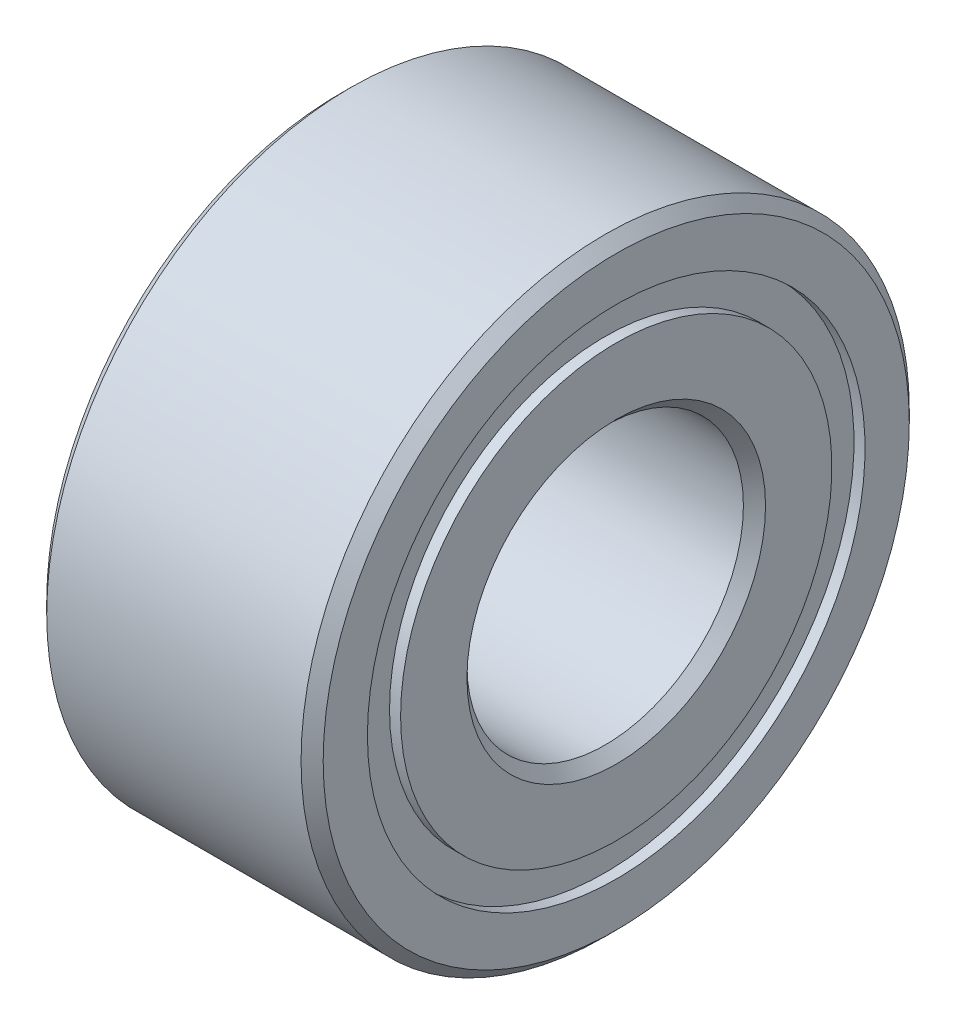
ISO-10303-21;
HEADER;
FILE_DESCRIPTION(('STEP AP214'),'2;1');
FILE_NAME('part.step','',(''),(''),'','','');
FILE_SCHEMA(('AUTOMOTIVE_DESIGN { 1 0 10303 214 1 1 1 1 }'));
ENDSEC;
DATA;
#1=APPLICATION_CONTEXT('core data for automotive mechanical design processes');
#2=APPLICATION_PROTOCOL_DEFINITION('international standard','automotive_design',2000,#1);
#3=PRODUCT_CONTEXT('',#1,'mechanical');
#4=PRODUCT('Part','Part','',(#3));
#5=PRODUCT_RELATED_PRODUCT_CATEGORY('part','',(#4));
#6=PRODUCT_DEFINITION_FORMATION('','',#4);
#7=PRODUCT_DEFINITION_CONTEXT('part definition',#1,'design');
#8=PRODUCT_DEFINITION('design','',#6,#7);
#9=PRODUCT_DEFINITION_SHAPE('','',#8);
#10=(LENGTH_UNIT() NAMED_UNIT(*) SI_UNIT(.MILLI.,.METRE.));
#11=(NAMED_UNIT(*) PLANE_ANGLE_UNIT() SI_UNIT($,.RADIAN.));
#12=(NAMED_UNIT(*) SI_UNIT($,.STERADIAN.) SOLID_ANGLE_UNIT());
#13=UNCERTAINTY_MEASURE_WITH_UNIT(LENGTH_MEASURE(1.E-05),#10,'distance_accuracy_value','');
#14=(GEOMETRIC_REPRESENTATION_CONTEXT(3) GLOBAL_UNCERTAINTY_ASSIGNED_CONTEXT((#13)) GLOBAL_UNIT_ASSIGNED_CONTEXT((#10,
#11,#12)) REPRESENTATION_CONTEXT('',''));
#15=CARTESIAN_POINT('',(0.,0.,0.));
#16=DIRECTION('',(0.,0.,1.));
#17=DIRECTION('',(1.,0.,0.));
#18=AXIS2_PLACEMENT_3D('',#15,#16,#17);
#19=CARTESIAN_POINT('',(-2.5,3.9,0.));
#20=DIRECTION('',(1.,0.,0.));
#21=DIRECTION('',(0.,0.,-1.));
#22=AXIS2_PLACEMENT_3D('',#19,#20,#21);
#23=PLANE('',#22);
#24=CARTESIAN_POINT('',(-2.5,0.,0.));
#25=DIRECTION('',(1.,0.,0.));
#26=DIRECTION('',(0.,0.,-1.));
#27=AXIS2_PLACEMENT_3D('',#24,#25,#26);
#28=CIRCLE('',#27,2.7);
#29=CARTESIAN_POINT('',(-2.5,0.,-2.7));
#30=VERTEX_POINT('',#29);
#31=EDGE_CURVE('E42',#30,#30,#28,.T.);
#32=ORIENTED_EDGE('',*,*,#31,.T.);
#33=EDGE_LOOP('',(#32));
#34=FACE_BOUND('',#33,.T.);
#35=CARTESIAN_POINT('',(-2.5,0.,0.));
#36=DIRECTION('',(-1.,0.,0.));
#37=DIRECTION('',(0.,0.,1.));
#38=AXIS2_PLACEMENT_3D('',#35,#36,#37);
#39=CIRCLE('',#38,3.9);
#40=CARTESIAN_POINT('',(-2.5,0.,3.9));
#41=VERTEX_POINT('',#40);
#42=EDGE_CURVE('E67',#41,#41,#39,.T.);
#43=ORIENTED_EDGE('',*,*,#42,.T.);
#44=EDGE_LOOP('',(#43));
#45=FACE_BOUND('',#44,.T.);
#46=ADVANCED_FACE('F34',(#34,#45),#23,.F.);
#47=CARTESIAN_POINT('',(-9.57865229498036,0.,0.));
#48=DIRECTION('',(-1.,0.,0.));
#49=DIRECTION('',(0.,0.,1.));
#50=AXIS2_PLACEMENT_3D('',#47,#48,#49);
#51=CYLINDRICAL_SURFACE('',#50,3.9);
#52=ORIENTED_EDGE('',*,*,#42,.F.);
#53=EDGE_LOOP('',(#52));
#54=FACE_BOUND('',#53,.T.);
#55=CARTESIAN_POINT('',(-2.3,0.,0.));
#56=DIRECTION('',(-1.,0.,0.));
#57=DIRECTION('',(0.,0.,1.));
#58=AXIS2_PLACEMENT_3D('',#55,#56,#57);
#59=CIRCLE('',#58,3.9);
#60=CARTESIAN_POINT('',(-2.3,0.,3.9));
#61=VERTEX_POINT('',#60);
#62=EDGE_CURVE('E70',#61,#61,#59,.T.);
#63=ORIENTED_EDGE('',*,*,#62,.T.);
#64=EDGE_LOOP('',(#63));
#65=FACE_BOUND('',#64,.T.);
#66=ADVANCED_FACE('F109',(#54,#65),#51,.T.);
#67=CARTESIAN_POINT('',(-2.3,4.5,0.));
#68=DIRECTION('',(1.,0.,0.));
#69=DIRECTION('',(0.,0.,-1.));
#70=AXIS2_PLACEMENT_3D('',#67,#68,#69);
#71=PLANE('',#70);
#72=ORIENTED_EDGE('',*,*,#62,.F.);
#73=EDGE_LOOP('',(#72));
#74=FACE_BOUND('',#73,.T.);
#75=CARTESIAN_POINT('',(-2.3,0.,0.));
#76=DIRECTION('',(-1.,0.,0.));
#77=DIRECTION('',(0.,0.,1.));
#78=AXIS2_PLACEMENT_3D('',#75,#76,#77);
#79=CIRCLE('',#78,4.5);
#80=CARTESIAN_POINT('',(-2.3,0.,4.5));
#81=VERTEX_POINT('',#80);
#82=EDGE_CURVE('E73',#81,#81,#79,.T.);
#83=ORIENTED_EDGE('',*,*,#82,.T.);
#84=EDGE_LOOP('',(#83));
#85=FACE_BOUND('',#84,.T.);
#86=ADVANCED_FACE('F114',(#74,#85),#71,.F.);
#87=CARTESIAN_POINT('',(-9.57865229498036,0.,0.));
#88=DIRECTION('',(-1.,0.,0.));
#89=DIRECTION('',(0.,0.,1.));
#90=AXIS2_PLACEMENT_3D('',#87,#88,#89);
#91=CYLINDRICAL_SURFACE('',#90,4.5);
#92=ORIENTED_EDGE('',*,*,#82,.F.);
#93=EDGE_LOOP('',(#92));
#94=FACE_BOUND('',#93,.T.);
#95=CARTESIAN_POINT('',(-2.5,0.,0.));
#96=DIRECTION('',(-1.,0.,0.));
#97=DIRECTION('',(0.,0.,1.));
#98=AXIS2_PLACEMENT_3D('',#95,#96,#97);
#99=CIRCLE('',#98,4.5);
#100=CARTESIAN_POINT('',(-2.5,0.,4.5));
#101=VERTEX_POINT('',#100);
#102=EDGE_CURVE('E76',#101,#101,#99,.T.);
#103=ORIENTED_EDGE('',*,*,#102,.T.);
#104=EDGE_LOOP('',(#103));
#105=FACE_BOUND('',#104,.T.);
#106=ADVANCED_FACE('F208',(#94,#105),#91,.F.);
#107=CARTESIAN_POINT('',(-2.5,5.5,0.));
#108=DIRECTION('',(1.,0.,0.));
#109=DIRECTION('',(0.,0.,-1.));
#110=AXIS2_PLACEMENT_3D('',#107,#108,#109);
#111=PLANE('',#110);
#112=CARTESIAN_POINT('',(-2.5,0.,0.));
#113=DIRECTION('',(1.,0.,0.));
#114=DIRECTION('',(0.,0.,-1.));
#115=AXIS2_PLACEMENT_3D('',#112,#113,#114);
#116=CIRCLE('',#115,5.3);
#117=CARTESIAN_POINT('',(-2.5,0.,-5.3));
#118=VERTEX_POINT('',#117);
#119=EDGE_CURVE('E55',#118,#118,#116,.F.);
#120=ORIENTED_EDGE('',*,*,#119,.T.);
#121=EDGE_LOOP('',(#120));
#122=FACE_BOUND('',#121,.T.);
#123=ORIENTED_EDGE('',*,*,#102,.F.);
#124=EDGE_LOOP('',(#123));
#125=FACE_BOUND('',#124,.T.);
#126=ADVANCED_FACE('F199',(#122,#125),#111,.F.);
#127=CARTESIAN_POINT('',(-9.57865229498036,0.,0.));
#128=DIRECTION('',(-1.,0.,0.));
#129=DIRECTION('',(0.,0.,1.));
#130=AXIS2_PLACEMENT_3D('',#127,#128,#129);
#131=CYLINDRICAL_SURFACE('',#130,5.5);
#132=CARTESIAN_POINT('',(2.3,0.,0.));
#133=DIRECTION('',(-1.,0.,0.));
#134=DIRECTION('',(0.,0.,1.));
#135=AXIS2_PLACEMENT_3D('',#132,#133,#134);
#136=CIRCLE('',#135,5.5);
#137=CARTESIAN_POINT('',(2.3,0.,5.5));
#138=VERTEX_POINT('',#137);
#139=EDGE_CURVE('E61',#138,#138,#136,.T.);
#140=ORIENTED_EDGE('',*,*,#139,.T.);
#141=EDGE_LOOP('',(#140));
#142=FACE_BOUND('',#141,.T.);
#143=CARTESIAN_POINT('',(-2.29999999999999,0.,0.));
#144=DIRECTION('',(1.,0.,0.));
#145=DIRECTION('',(0.,0.,-1.));
#146=AXIS2_PLACEMENT_3D('',#143,#144,#145);
#147=CIRCLE('',#146,5.5);
#148=CARTESIAN_POINT('',(-2.29999999999999,0.,-5.5));
#149=VERTEX_POINT('',#148);
#150=EDGE_CURVE('E64',#149,#149,#147,.T.);
#151=ORIENTED_EDGE('',*,*,#150,.T.);
#152=EDGE_LOOP('',(#151));
#153=FACE_BOUND('',#152,.T.);
#154=ADVANCED_FACE('F187',(#142,#153),#131,.T.);
#155=CARTESIAN_POINT('',(2.5,5.5,0.));
#156=DIRECTION('',(-1.,0.,0.));
#157=DIRECTION('',(0.,0.,1.));
#158=AXIS2_PLACEMENT_3D('',#155,#156,#157);
#159=PLANE('',#158);
#160=CARTESIAN_POINT('',(2.5,0.,0.));
#161=DIRECTION('',(-1.,0.,0.));
#162=DIRECTION('',(0.,0.,1.));
#163=AXIS2_PLACEMENT_3D('',#160,#161,#162);
#164=CIRCLE('',#163,5.3);
#165=CARTESIAN_POINT('',(2.5,0.,5.3));
#166=VERTEX_POINT('',#165);
#167=EDGE_CURVE('E58',#166,#166,#164,.F.);
#168=ORIENTED_EDGE('',*,*,#167,.T.);
#169=EDGE_LOOP('',(#168));
#170=FACE_BOUND('',#169,.T.);
#171=CARTESIAN_POINT('',(2.5,0.,0.));
#172=DIRECTION('',(-1.,0.,0.));
#173=DIRECTION('',(0.,0.,1.));
#174=AXIS2_PLACEMENT_3D('',#171,#172,#173);
#175=CIRCLE('',#174,4.5);
#176=CARTESIAN_POINT('',(2.5,0.,4.5));
#177=VERTEX_POINT('',#176);
#178=EDGE_CURVE('E79',#177,#177,#175,.T.);
#179=ORIENTED_EDGE('',*,*,#178,.T.);
#180=EDGE_LOOP('',(#179));
#181=FACE_BOUND('',#180,.T.);
#182=ADVANCED_FACE('F181',(#170,#181),#159,.F.);
#183=CARTESIAN_POINT('',(-9.57865229498036,0.,0.));
#184=DIRECTION('',(-1.,0.,0.));
#185=DIRECTION('',(0.,0.,1.));
#186=AXIS2_PLACEMENT_3D('',#183,#184,#185);
#187=CYLINDRICAL_SURFACE('',#186,4.5);
#188=ORIENTED_EDGE('',*,*,#178,.F.);
#189=EDGE_LOOP('',(#188));
#190=FACE_BOUND('',#189,.T.);
#191=CARTESIAN_POINT('',(2.3,0.,0.));
#192=DIRECTION('',(-1.,0.,0.));
#193=DIRECTION('',(0.,0.,1.));
#194=AXIS2_PLACEMENT_3D('',#191,#192,#193);
#195=CIRCLE('',#194,4.5);
#196=CARTESIAN_POINT('',(2.3,0.,4.5));
#197=VERTEX_POINT('',#196);
#198=EDGE_CURVE('E82',#197,#197,#195,.T.);
#199=ORIENTED_EDGE('',*,*,#198,.T.);
#200=EDGE_LOOP('',(#199));
#201=FACE_BOUND('',#200,.T.);
#202=ADVANCED_FACE('F186',(#190,#201),#187,.F.);
#203=CARTESIAN_POINT('',(2.3,4.5,0.));
#204=DIRECTION('',(-1.,0.,0.));
#205=DIRECTION('',(0.,0.,1.));
#206=AXIS2_PLACEMENT_3D('',#203,#204,#205);
#207=PLANE('',#206);
#208=ORIENTED_EDGE('',*,*,#198,.F.);
#209=EDGE_LOOP('',(#208));
#210=FACE_BOUND('',#209,.T.);
#211=CARTESIAN_POINT('',(2.3,0.,0.));
#212=DIRECTION('',(-1.,0.,0.));
#213=DIRECTION('',(0.,0.,1.));
#214=AXIS2_PLACEMENT_3D('',#211,#212,#213);
#215=CIRCLE('',#214,3.9);
#216=CARTESIAN_POINT('',(2.3,0.,3.9));
#217=VERTEX_POINT('',#216);
#218=EDGE_CURVE('E85',#217,#217,#215,.T.);
#219=ORIENTED_EDGE('',*,*,#218,.T.);
#220=EDGE_LOOP('',(#219));
#221=FACE_BOUND('',#220,.T.);
#222=ADVANCED_FACE('F105',(#210,#221),#207,.F.);
#223=CARTESIAN_POINT('',(-9.57865229498036,0.,0.));
#224=DIRECTION('',(-1.,0.,0.));
#225=DIRECTION('',(0.,0.,1.));
#226=AXIS2_PLACEMENT_3D('',#223,#224,#225);
#227=CYLINDRICAL_SURFACE('',#226,3.9);
#228=ORIENTED_EDGE('',*,*,#218,.F.);
#229=EDGE_LOOP('',(#228));
#230=FACE_BOUND('',#229,.T.);
#231=CARTESIAN_POINT('',(2.5,0.,0.));
#232=DIRECTION('',(-1.,0.,0.));
#233=DIRECTION('',(0.,0.,1.));
#234=AXIS2_PLACEMENT_3D('',#231,#232,#233);
#235=CIRCLE('',#234,3.9);
#236=CARTESIAN_POINT('',(2.5,0.,3.9));
#237=VERTEX_POINT('',#236);
#238=EDGE_CURVE('E88',#237,#237,#235,.T.);
#239=ORIENTED_EDGE('',*,*,#238,.T.);
#240=EDGE_LOOP('',(#239));
#241=FACE_BOUND('',#240,.T.);
#242=ADVANCED_FACE('F92',(#230,#241),#227,.T.);
#243=CARTESIAN_POINT('',(2.5,3.9,0.));
#244=DIRECTION('',(-1.,0.,0.));
#245=DIRECTION('',(0.,0.,1.));
#246=AXIS2_PLACEMENT_3D('',#243,#244,#245);
#247=PLANE('',#246);
#248=CARTESIAN_POINT('',(2.5,0.,0.));
#249=DIRECTION('',(-1.,0.,0.));
#250=DIRECTION('',(0.,0.,1.));
#251=AXIS2_PLACEMENT_3D('',#248,#249,#250);
#252=CIRCLE('',#251,2.7);
#253=CARTESIAN_POINT('',(2.5,0.,2.7));
#254=VERTEX_POINT('',#253);
#255=EDGE_CURVE('E10',#254,#254,#252,.T.);
#256=ORIENTED_EDGE('',*,*,#255,.T.);
#257=EDGE_LOOP('',(#256));
#258=FACE_BOUND('',#257,.T.);
#259=ORIENTED_EDGE('',*,*,#238,.F.);
#260=EDGE_LOOP('',(#259));
#261=FACE_BOUND('',#260,.T.);
#262=ADVANCED_FACE('F94',(#258,#261),#247,.F.);
#263=CARTESIAN_POINT('',(-9.57865229498036,0.,0.));
#264=DIRECTION('',(-1.,0.,0.));
#265=DIRECTION('',(0.,0.,1.));
#266=AXIS2_PLACEMENT_3D('',#263,#264,#265);
#267=CYLINDRICAL_SURFACE('',#266,2.5);
#268=CARTESIAN_POINT('',(-2.3,0.,0.));
#269=DIRECTION('',(1.,0.,0.));
#270=DIRECTION('',(0.,0.,-1.));
#271=AXIS2_PLACEMENT_3D('',#268,#269,#270);
#272=CIRCLE('',#271,2.5);
#273=CARTESIAN_POINT('',(-2.3,0.,-2.5));
#274=VERTEX_POINT('',#273);
#275=EDGE_CURVE('E46',#274,#274,#272,.F.);
#276=ORIENTED_EDGE('',*,*,#275,.T.);
#277=EDGE_LOOP('',(#276));
#278=FACE_BOUND('',#277,.T.);
#279=CARTESIAN_POINT('',(2.3,0.,0.));
#280=DIRECTION('',(-1.,0.,0.));
#281=DIRECTION('',(0.,0.,1.));
#282=AXIS2_PLACEMENT_3D('',#279,#280,#281);
#283=CIRCLE('',#282,2.5);
#284=CARTESIAN_POINT('',(2.3,0.,2.5));
#285=VERTEX_POINT('',#284);
#286=EDGE_CURVE('E50',#285,#285,#283,.F.);
#287=ORIENTED_EDGE('',*,*,#286,.T.);
#288=EDGE_LOOP('',(#287));
#289=FACE_BOUND('',#288,.T.);
#290=ADVANCED_FACE('F96',(#278,#289),#267,.F.);
#291=CARTESIAN_POINT('',(2.3,0.,0.));
#292=DIRECTION('',(-1.,0.,0.));
#293=DIRECTION('',(0.,0.,1.));
#294=AXIS2_PLACEMENT_3D('',#291,#292,#293);
#295=CONICAL_SURFACE('',#294,5.5,0.785398163397448);
#296=ORIENTED_EDGE('',*,*,#167,.F.);
#297=EDGE_LOOP('',(#296));
#298=FACE_BOUND('',#297,.T.);
#299=ORIENTED_EDGE('',*,*,#139,.F.);
#300=EDGE_LOOP('',(#299));
#301=FACE_BOUND('',#300,.T.);
#302=ADVANCED_FACE('F102',(#298,#301),#295,.T.);
#303=CARTESIAN_POINT('',(-2.5,0.,0.));
#304=DIRECTION('',(1.,0.,0.));
#305=DIRECTION('',(0.,0.,-1.));
#306=AXIS2_PLACEMENT_3D('',#303,#304,#305);
#307=CONICAL_SURFACE('',#306,5.3,0.785398163397444);
#308=ORIENTED_EDGE('',*,*,#150,.F.);
#309=EDGE_LOOP('',(#308));
#310=FACE_BOUND('',#309,.T.);
#311=ORIENTED_EDGE('',*,*,#119,.F.);
#312=EDGE_LOOP('',(#311));
#313=FACE_BOUND('',#312,.T.);
#314=ADVANCED_FACE('F126',(#310,#313),#307,.T.);
#315=CARTESIAN_POINT('',(-2.3,0.,0.));
#316=DIRECTION('',(-1.,0.,0.));
#317=DIRECTION('',(0.,0.,1.));
#318=AXIS2_PLACEMENT_3D('',#315,#316,#317);
#319=CONICAL_SURFACE('',#318,2.5,0.785398163397454);
#320=ORIENTED_EDGE('',*,*,#31,.F.);
#321=EDGE_LOOP('',(#320));
#322=FACE_BOUND('',#321,.T.);
#323=ORIENTED_EDGE('',*,*,#275,.F.);
#324=EDGE_LOOP('',(#323));
#325=FACE_BOUND('',#324,.T.);
#326=ADVANCED_FACE('F132',(#322,#325),#319,.F.);
#327=CARTESIAN_POINT('',(2.5,0.,0.));
#328=DIRECTION('',(1.,0.,0.));
#329=DIRECTION('',(0.,0.,-1.));
#330=AXIS2_PLACEMENT_3D('',#327,#328,#329);
#331=CONICAL_SURFACE('',#330,2.7,0.785398163397449);
#332=ORIENTED_EDGE('',*,*,#286,.F.);
#333=EDGE_LOOP('',(#332));
#334=FACE_BOUND('',#333,.T.);
#335=ORIENTED_EDGE('',*,*,#255,.F.);
#336=EDGE_LOOP('',(#335));
#337=FACE_BOUND('',#336,.T.);
#338=ADVANCED_FACE('F37',(#334,#337),#331,.F.);
#339=CLOSED_SHELL('',(#46,#66,#86,#106,#126,#154,#182,#202,#222,#242,#262,#290,#302,#314,#326,#338));
#340=MANIFOLD_SOLID_BREP('B2',#339);
#341=ADVANCED_BREP_SHAPE_REPRESENTATION('',(#18,#340),#14);
#342=SHAPE_DEFINITION_REPRESENTATION(#9,#341);
ENDSEC;
END-ISO-10303-21;
